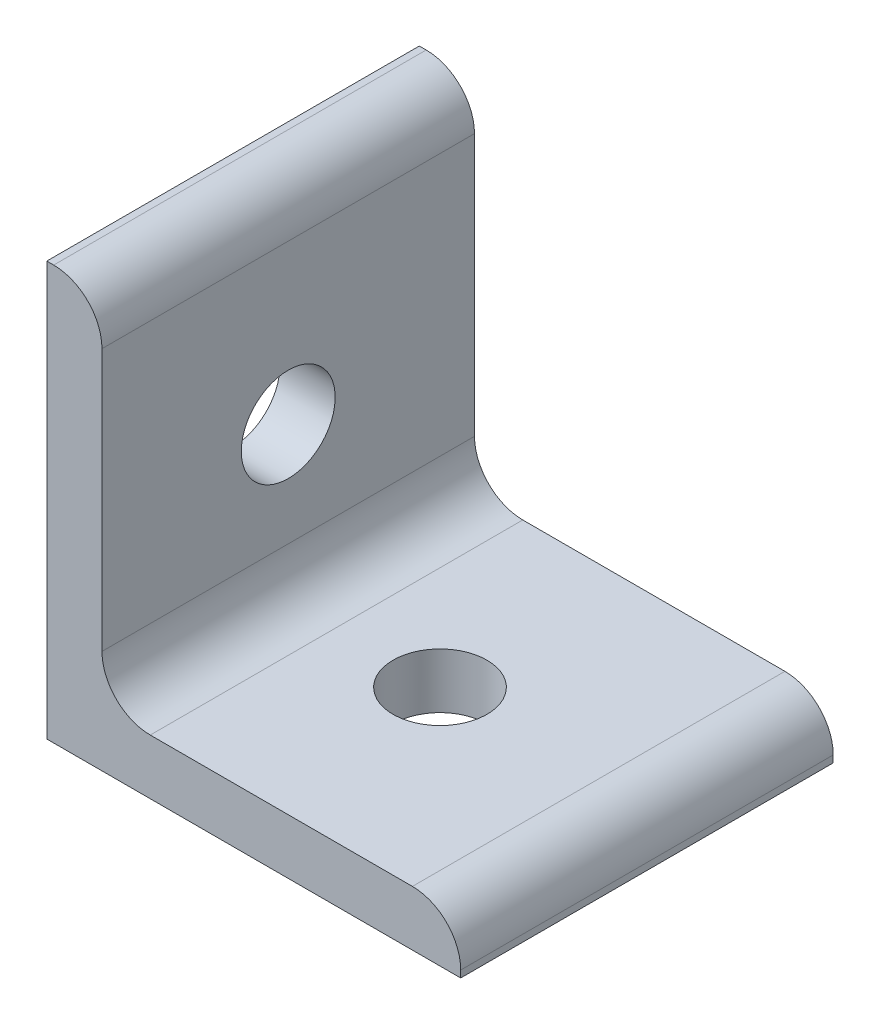
ISO-10303-21;
HEADER;
FILE_DESCRIPTION(('STEP AP214'),'2;1');
FILE_NAME('part.step','',(''),(''),'','','');
FILE_SCHEMA(('AUTOMOTIVE_DESIGN { 1 0 10303 214 1 1 1 1 }'));
ENDSEC;
DATA;
#1=APPLICATION_CONTEXT('core data for automotive mechanical design processes');
#2=APPLICATION_PROTOCOL_DEFINITION('international standard','automotive_design',2000,#1);
#3=PRODUCT_CONTEXT('',#1,'mechanical');
#4=PRODUCT('Part','Part','',(#3));
#5=PRODUCT_RELATED_PRODUCT_CATEGORY('part','',(#4));
#6=PRODUCT_DEFINITION_FORMATION('','',#4);
#7=PRODUCT_DEFINITION_CONTEXT('part definition',#1,'design');
#8=PRODUCT_DEFINITION('design','',#6,#7);
#9=PRODUCT_DEFINITION_SHAPE('','',#8);
#10=(LENGTH_UNIT() NAMED_UNIT(*) SI_UNIT(.MILLI.,.METRE.));
#11=(NAMED_UNIT(*) PLANE_ANGLE_UNIT() SI_UNIT($,.RADIAN.));
#12=(NAMED_UNIT(*) SI_UNIT($,.STERADIAN.) SOLID_ANGLE_UNIT());
#13=UNCERTAINTY_MEASURE_WITH_UNIT(LENGTH_MEASURE(1.E-05),#10,'distance_accuracy_value','');
#14=(GEOMETRIC_REPRESENTATION_CONTEXT(3) GLOBAL_UNCERTAINTY_ASSIGNED_CONTEXT((#13)) GLOBAL_UNIT_ASSIGNED_CONTEXT((#10,
#11,#12)) REPRESENTATION_CONTEXT('',''));
#15=CARTESIAN_POINT('',(0.,0.,0.));
#16=DIRECTION('',(0.,0.,1.));
#17=DIRECTION('',(1.,0.,0.));
#18=AXIS2_PLACEMENT_3D('',#15,#16,#17);
#19=CARTESIAN_POINT('',(0.,0.,-13.5));
#20=DIRECTION('',(-1.,0.,0.));
#21=DIRECTION('',(0.,0.,1.));
#22=AXIS2_PLACEMENT_3D('',#19,#20,#21);
#23=PLANE('',#22);
#24=CARTESIAN_POINT('',(0.,15.,0.));
#25=DIRECTION('',(-1.,0.,0.));
#26=DIRECTION('',(0.,0.,1.));
#27=AXIS2_PLACEMENT_3D('',#24,#25,#26);
#28=CIRCLE('',#27,3.4036);
#29=CARTESIAN_POINT('',(0.,15.,3.4036));
#30=VERTEX_POINT('',#29);
#31=EDGE_CURVE('E252',#30,#30,#28,.T.);
#32=ORIENTED_EDGE('',*,*,#31,.F.);
#33=EDGE_LOOP('',(#32));
#34=FACE_BOUND('',#33,.T.);
#35=DIRECTION('',(0.,-1.,0.));
#36=VECTOR('',#35,1.);
#37=CARTESIAN_POINT('',(0.,0.,13.5));
#38=LINE('',#37,#36);
#39=CARTESIAN_POINT('',(0.,30.,13.5));
#40=VERTEX_POINT('',#39);
#41=CARTESIAN_POINT('',(0.,0.,13.5));
#42=VERTEX_POINT('',#41);
#43=EDGE_CURVE('E153',#40,#42,#38,.T.);
#44=ORIENTED_EDGE('',*,*,#43,.F.);
#45=DIRECTION('',(0.,0.,1.));
#46=VECTOR('',#45,1.);
#47=CARTESIAN_POINT('',(0.,30.,-13.5));
#48=LINE('',#47,#46);
#49=CARTESIAN_POINT('',(0.,30.,-13.5));
#50=VERTEX_POINT('',#49);
#51=EDGE_CURVE('E11',#50,#40,#48,.T.);
#52=ORIENTED_EDGE('',*,*,#51,.F.);
#53=DIRECTION('',(0.,-1.,0.));
#54=VECTOR('',#53,1.);
#55=CARTESIAN_POINT('',(0.,0.,-13.5));
#56=LINE('',#55,#54);
#57=CARTESIAN_POINT('',(0.,0.,-13.5));
#58=VERTEX_POINT('',#57);
#59=EDGE_CURVE('E185',#50,#58,#56,.T.);
#60=ORIENTED_EDGE('',*,*,#59,.T.);
#61=DIRECTION('',(0.,0.,1.));
#62=VECTOR('',#61,1.);
#63=CARTESIAN_POINT('',(0.,0.,-13.5));
#64=LINE('',#63,#62);
#65=EDGE_CURVE('E103',#58,#42,#64,.T.);
#66=ORIENTED_EDGE('',*,*,#65,.T.);
#67=EDGE_LOOP('',(#44,#52,#60,#66));
#68=FACE_BOUND('',#67,.T.);
#69=ADVANCED_FACE('F43',(#34,#68),#23,.T.);
#70=CARTESIAN_POINT('',(0.,30.,-13.5));
#71=DIRECTION('',(0.,1.,0.));
#72=DIRECTION('',(-1.,0.,0.));
#73=AXIS2_PLACEMENT_3D('',#70,#71,#72);
#74=PLANE('',#73);
#75=DIRECTION('',(-1.,0.,0.));
#76=VECTOR('',#75,1.);
#77=CARTESIAN_POINT('',(0.,30.,13.5));
#78=LINE('',#77,#76);
#79=CARTESIAN_POINT('',(0.499999999999999,30.,13.5));
#80=VERTEX_POINT('',#79);
#81=EDGE_CURVE('E182',#80,#40,#78,.T.);
#82=ORIENTED_EDGE('',*,*,#81,.F.);
#83=DIRECTION('',(0.,0.,1.));
#84=VECTOR('',#83,1.);
#85=CARTESIAN_POINT('',(0.499999999999999,30.,-13.5));
#86=LINE('',#85,#84);
#87=CARTESIAN_POINT('',(0.499999999999999,30.,-13.5));
#88=VERTEX_POINT('',#87);
#89=EDGE_CURVE('E53',#88,#80,#86,.T.);
#90=ORIENTED_EDGE('',*,*,#89,.F.);
#91=DIRECTION('',(-1.,0.,0.));
#92=VECTOR('',#91,1.);
#93=CARTESIAN_POINT('',(0.,30.,-13.5));
#94=LINE('',#93,#92);
#95=EDGE_CURVE('E139',#88,#50,#94,.T.);
#96=ORIENTED_EDGE('',*,*,#95,.T.);
#97=ORIENTED_EDGE('',*,*,#51,.T.);
#98=EDGE_LOOP('',(#82,#90,#96,#97));
#99=FACE_BOUND('',#98,.T.);
#100=ADVANCED_FACE('F207',(#99),#74,.T.);
#101=CARTESIAN_POINT('',(0.499999999999999,26.5,-13.5));
#102=DIRECTION('',(0.,0.,1.));
#103=DIRECTION('',(1.,0.,0.));
#104=AXIS2_PLACEMENT_3D('',#101,#102,#103);
#105=CYLINDRICAL_SURFACE('',#104,3.5);
#106=CARTESIAN_POINT('',(0.499999999999999,26.5,13.5));
#107=DIRECTION('',(0.,0.,1.));
#108=DIRECTION('',(-1.,0.,0.));
#109=AXIS2_PLACEMENT_3D('',#106,#107,#108);
#110=CIRCLE('',#109,3.5);
#111=CARTESIAN_POINT('',(4.,26.5,13.5));
#112=VERTEX_POINT('',#111);
#113=EDGE_CURVE('E125',#112,#80,#110,.T.);
#114=ORIENTED_EDGE('',*,*,#113,.F.);
#115=DIRECTION('',(0.,0.,1.));
#116=VECTOR('',#115,1.);
#117=CARTESIAN_POINT('',(4.,26.5,-13.5));
#118=LINE('',#117,#116);
#119=CARTESIAN_POINT('',(4.,26.5,-13.5));
#120=VERTEX_POINT('',#119);
#121=EDGE_CURVE('E120',#120,#112,#118,.T.);
#122=ORIENTED_EDGE('',*,*,#121,.F.);
#123=CARTESIAN_POINT('',(0.499999999999999,26.5,-13.5));
#124=DIRECTION('',(0.,0.,1.));
#125=DIRECTION('',(-1.,0.,0.));
#126=AXIS2_PLACEMENT_3D('',#123,#124,#125);
#127=CIRCLE('',#126,3.5);
#128=EDGE_CURVE('E123',#120,#88,#127,.T.);
#129=ORIENTED_EDGE('',*,*,#128,.T.);
#130=ORIENTED_EDGE('',*,*,#89,.T.);
#131=EDGE_LOOP('',(#114,#122,#129,#130));
#132=FACE_BOUND('',#131,.T.);
#133=ADVANCED_FACE('F122',(#132),#105,.T.);
#134=CARTESIAN_POINT('',(4.,26.5,-13.5));
#135=DIRECTION('',(1.,0.,0.));
#136=DIRECTION('',(0.,1.,0.));
#137=AXIS2_PLACEMENT_3D('',#134,#135,#136);
#138=PLANE('',#137);
#139=CARTESIAN_POINT('',(4.,15.,0.));
#140=DIRECTION('',(1.,0.,0.));
#141=DIRECTION('',(0.,1.,0.));
#142=AXIS2_PLACEMENT_3D('',#139,#140,#141);
#143=CIRCLE('',#142,3.4036);
#144=CARTESIAN_POINT('',(4.,18.4036,0.));
#145=VERTEX_POINT('',#144);
#146=EDGE_CURVE('E46',#145,#145,#143,.T.);
#147=ORIENTED_EDGE('',*,*,#146,.F.);
#148=EDGE_LOOP('',(#147));
#149=FACE_BOUND('',#148,.T.);
#150=DIRECTION('',(0.,1.,0.));
#151=VECTOR('',#150,1.);
#152=CARTESIAN_POINT('',(4.,26.5,13.5));
#153=LINE('',#152,#151);
#154=CARTESIAN_POINT('',(4.,7.5,13.5));
#155=VERTEX_POINT('',#154);
#156=EDGE_CURVE('E177',#155,#112,#153,.T.);
#157=ORIENTED_EDGE('',*,*,#156,.F.);
#158=DIRECTION('',(0.,0.,1.));
#159=VECTOR('',#158,1.);
#160=CARTESIAN_POINT('',(4.,7.5,-13.5));
#161=LINE('',#160,#159);
#162=CARTESIAN_POINT('',(4.,7.5,-13.5));
#163=VERTEX_POINT('',#162);
#164=EDGE_CURVE('E131',#163,#155,#161,.T.);
#165=ORIENTED_EDGE('',*,*,#164,.F.);
#166=DIRECTION('',(0.,1.,0.));
#167=VECTOR('',#166,1.);
#168=CARTESIAN_POINT('',(4.,26.5,-13.5));
#169=LINE('',#168,#167);
#170=EDGE_CURVE('E137',#163,#120,#169,.T.);
#171=ORIENTED_EDGE('',*,*,#170,.T.);
#172=ORIENTED_EDGE('',*,*,#121,.T.);
#173=EDGE_LOOP('',(#157,#165,#171,#172));
#174=FACE_BOUND('',#173,.T.);
#175=ADVANCED_FACE('F142',(#149,#174),#138,.T.);
#176=CARTESIAN_POINT('',(7.5,7.5,-13.5));
#177=DIRECTION('',(0.,0.,1.));
#178=DIRECTION('',(1.,0.,0.));
#179=AXIS2_PLACEMENT_3D('',#176,#177,#178);
#180=CYLINDRICAL_SURFACE('',#179,3.5);
#181=CARTESIAN_POINT('',(7.5,7.5,13.5));
#182=DIRECTION('',(0.,0.,-1.));
#183=DIRECTION('',(-1.,0.,0.));
#184=AXIS2_PLACEMENT_3D('',#181,#182,#183);
#185=CIRCLE('',#184,3.5);
#186=CARTESIAN_POINT('',(7.5,4.,13.5));
#187=VERTEX_POINT('',#186);
#188=EDGE_CURVE('E173',#187,#155,#185,.T.);
#189=ORIENTED_EDGE('',*,*,#188,.F.);
#190=DIRECTION('',(0.,0.,1.));
#191=VECTOR('',#190,1.);
#192=CARTESIAN_POINT('',(7.5,4.,-13.5));
#193=LINE('',#192,#191);
#194=CARTESIAN_POINT('',(7.5,4.,-13.5));
#195=VERTEX_POINT('',#194);
#196=EDGE_CURVE('E191',#195,#187,#193,.T.);
#197=ORIENTED_EDGE('',*,*,#196,.F.);
#198=CARTESIAN_POINT('',(7.5,7.5,-13.5));
#199=DIRECTION('',(0.,0.,-1.));
#200=DIRECTION('',(-1.,0.,0.));
#201=AXIS2_PLACEMENT_3D('',#198,#199,#200);
#202=CIRCLE('',#201,3.5);
#203=EDGE_CURVE('E144',#195,#163,#202,.T.);
#204=ORIENTED_EDGE('',*,*,#203,.T.);
#205=ORIENTED_EDGE('',*,*,#164,.T.);
#206=EDGE_LOOP('',(#189,#197,#204,#205));
#207=FACE_BOUND('',#206,.T.);
#208=ADVANCED_FACE('F221',(#207),#180,.F.);
#209=CARTESIAN_POINT('',(26.5,4.,-13.5));
#210=DIRECTION('',(0.,1.,0.));
#211=DIRECTION('',(-1.,0.,0.));
#212=AXIS2_PLACEMENT_3D('',#209,#210,#211);
#213=PLANE('',#212);
#214=CARTESIAN_POINT('',(15.,4.,0.));
#215=DIRECTION('',(0.,1.,0.));
#216=DIRECTION('',(-1.,0.,0.));
#217=AXIS2_PLACEMENT_3D('',#214,#215,#216);
#218=CIRCLE('',#217,3.4036);
#219=CARTESIAN_POINT('',(11.5964,4.,0.));
#220=VERTEX_POINT('',#219);
#221=EDGE_CURVE('E248',#220,#220,#218,.T.);
#222=ORIENTED_EDGE('',*,*,#221,.F.);
#223=EDGE_LOOP('',(#222));
#224=FACE_BOUND('',#223,.T.);
#225=DIRECTION('',(-1.,0.,0.));
#226=VECTOR('',#225,1.);
#227=CARTESIAN_POINT('',(26.5,4.,13.5));
#228=LINE('',#227,#226);
#229=CARTESIAN_POINT('',(26.5,4.,13.5));
#230=VERTEX_POINT('',#229);
#231=EDGE_CURVE('E169',#230,#187,#228,.T.);
#232=ORIENTED_EDGE('',*,*,#231,.F.);
#233=DIRECTION('',(0.,0.,1.));
#234=VECTOR('',#233,1.);
#235=CARTESIAN_POINT('',(26.5,4.,-13.5));
#236=LINE('',#235,#234);
#237=CARTESIAN_POINT('',(26.5,4.,-13.5));
#238=VERTEX_POINT('',#237);
#239=EDGE_CURVE('E194',#238,#230,#236,.T.);
#240=ORIENTED_EDGE('',*,*,#239,.F.);
#241=DIRECTION('',(-1.,0.,0.));
#242=VECTOR('',#241,1.);
#243=CARTESIAN_POINT('',(26.5,4.,-13.5));
#244=LINE('',#243,#242);
#245=EDGE_CURVE('E147',#238,#195,#244,.T.);
#246=ORIENTED_EDGE('',*,*,#245,.T.);
#247=ORIENTED_EDGE('',*,*,#196,.T.);
#248=EDGE_LOOP('',(#232,#240,#246,#247));
#249=FACE_BOUND('',#248,.T.);
#250=ADVANCED_FACE('F225',(#224,#249),#213,.T.);
#251=CARTESIAN_POINT('',(26.5,0.500000000000001,-13.5));
#252=DIRECTION('',(0.,0.,1.));
#253=DIRECTION('',(1.,0.,0.));
#254=AXIS2_PLACEMENT_3D('',#251,#252,#253);
#255=CYLINDRICAL_SURFACE('',#254,3.5);
#256=CARTESIAN_POINT('',(26.5,0.500000000000001,13.5));
#257=DIRECTION('',(0.,0.,1.));
#258=DIRECTION('',(1.,0.,0.));
#259=AXIS2_PLACEMENT_3D('',#256,#257,#258);
#260=CIRCLE('',#259,3.5);
#261=CARTESIAN_POINT('',(30.,0.500000000000001,13.5));
#262=VERTEX_POINT('',#261);
#263=EDGE_CURVE('E165',#262,#230,#260,.T.);
#264=ORIENTED_EDGE('',*,*,#263,.F.);
#265=DIRECTION('',(0.,0.,1.));
#266=VECTOR('',#265,1.);
#267=CARTESIAN_POINT('',(30.,0.500000000000001,-13.5));
#268=LINE('',#267,#266);
#269=CARTESIAN_POINT('',(30.,0.500000000000001,-13.5));
#270=VERTEX_POINT('',#269);
#271=EDGE_CURVE('E197',#270,#262,#268,.T.);
#272=ORIENTED_EDGE('',*,*,#271,.F.);
#273=CARTESIAN_POINT('',(26.5,0.500000000000001,-13.5));
#274=DIRECTION('',(0.,0.,1.));
#275=DIRECTION('',(1.,0.,0.));
#276=AXIS2_PLACEMENT_3D('',#273,#274,#275);
#277=CIRCLE('',#276,3.5);
#278=EDGE_CURVE('E267',#270,#238,#277,.T.);
#279=ORIENTED_EDGE('',*,*,#278,.T.);
#280=ORIENTED_EDGE('',*,*,#239,.T.);
#281=EDGE_LOOP('',(#264,#272,#279,#280));
#282=FACE_BOUND('',#281,.T.);
#283=ADVANCED_FACE('F229',(#282),#255,.T.);
#284=CARTESIAN_POINT('',(30.,0.,-13.5));
#285=DIRECTION('',(1.,0.,0.));
#286=DIRECTION('',(0.,1.,0.));
#287=AXIS2_PLACEMENT_3D('',#284,#285,#286);
#288=PLANE('',#287);
#289=DIRECTION('',(0.,1.,0.));
#290=VECTOR('',#289,1.);
#291=CARTESIAN_POINT('',(30.,0.,13.5));
#292=LINE('',#291,#290);
#293=CARTESIAN_POINT('',(30.,0.,13.5));
#294=VERTEX_POINT('',#293);
#295=EDGE_CURVE('E161',#294,#262,#292,.T.);
#296=ORIENTED_EDGE('',*,*,#295,.F.);
#297=DIRECTION('',(0.,0.,1.));
#298=VECTOR('',#297,1.);
#299=CARTESIAN_POINT('',(30.,0.,-13.5));
#300=LINE('',#299,#298);
#301=CARTESIAN_POINT('',(30.,0.,-13.5));
#302=VERTEX_POINT('',#301);
#303=EDGE_CURVE('E200',#302,#294,#300,.T.);
#304=ORIENTED_EDGE('',*,*,#303,.F.);
#305=DIRECTION('',(0.,1.,0.));
#306=VECTOR('',#305,1.);
#307=CARTESIAN_POINT('',(30.,0.,-13.5));
#308=LINE('',#307,#306);
#309=EDGE_CURVE('E263',#302,#270,#308,.T.);
#310=ORIENTED_EDGE('',*,*,#309,.T.);
#311=ORIENTED_EDGE('',*,*,#271,.T.);
#312=EDGE_LOOP('',(#296,#304,#310,#311));
#313=FACE_BOUND('',#312,.T.);
#314=ADVANCED_FACE('F233',(#313),#288,.T.);
#315=CARTESIAN_POINT('',(0.,0.,-13.5));
#316=DIRECTION('',(0.,-1.,0.));
#317=DIRECTION('',(0.,0.,-1.));
#318=AXIS2_PLACEMENT_3D('',#315,#316,#317);
#319=PLANE('',#318);
#320=CARTESIAN_POINT('',(15.,0.,0.));
#321=DIRECTION('',(0.,-1.,0.));
#322=DIRECTION('',(0.,0.,-1.));
#323=AXIS2_PLACEMENT_3D('',#320,#321,#322);
#324=CIRCLE('',#323,3.4036);
#325=CARTESIAN_POINT('',(15.,0.,-3.4036));
#326=VERTEX_POINT('',#325);
#327=EDGE_CURVE('E245',#326,#326,#324,.T.);
#328=ORIENTED_EDGE('',*,*,#327,.F.);
#329=EDGE_LOOP('',(#328));
#330=FACE_BOUND('',#329,.T.);
#331=DIRECTION('',(1.,0.,0.));
#332=VECTOR('',#331,1.);
#333=CARTESIAN_POINT('',(0.,0.,13.5));
#334=LINE('',#333,#332);
#335=EDGE_CURVE('E157',#42,#294,#334,.T.);
#336=ORIENTED_EDGE('',*,*,#335,.F.);
#337=ORIENTED_EDGE('',*,*,#65,.F.);
#338=DIRECTION('',(1.,0.,0.));
#339=VECTOR('',#338,1.);
#340=CARTESIAN_POINT('',(0.,0.,-13.5));
#341=LINE('',#340,#339);
#342=EDGE_CURVE('E260',#58,#302,#341,.T.);
#343=ORIENTED_EDGE('',*,*,#342,.T.);
#344=ORIENTED_EDGE('',*,*,#303,.T.);
#345=EDGE_LOOP('',(#336,#337,#343,#344));
#346=FACE_BOUND('',#345,.T.);
#347=ADVANCED_FACE('F203',(#330,#346),#319,.T.);
#348=CARTESIAN_POINT('',(0.499999999999999,26.5,-13.5));
#349=DIRECTION('',(0.,0.,-1.));
#350=DIRECTION('',(-1.,0.,0.));
#351=AXIS2_PLACEMENT_3D('',#348,#349,#350);
#352=PLANE('',#351);
#353=ORIENTED_EDGE('',*,*,#59,.F.);
#354=ORIENTED_EDGE('',*,*,#95,.F.);
#355=ORIENTED_EDGE('',*,*,#128,.F.);
#356=ORIENTED_EDGE('',*,*,#170,.F.);
#357=ORIENTED_EDGE('',*,*,#203,.F.);
#358=ORIENTED_EDGE('',*,*,#245,.F.);
#359=ORIENTED_EDGE('',*,*,#278,.F.);
#360=ORIENTED_EDGE('',*,*,#309,.F.);
#361=ORIENTED_EDGE('',*,*,#342,.F.);
#362=EDGE_LOOP('',(#353,#354,#355,#356,#357,#358,#359,#360,#361));
#363=FACE_BOUND('',#362,.T.);
#364=ADVANCED_FACE('F135',(#363),#352,.T.);
#365=CARTESIAN_POINT('',(0.499999999999999,26.5,13.5));
#366=DIRECTION('',(0.,0.,-1.));
#367=DIRECTION('',(-1.,0.,0.));
#368=AXIS2_PLACEMENT_3D('',#365,#366,#367);
#369=PLANE('',#368);
#370=ORIENTED_EDGE('',*,*,#43,.T.);
#371=ORIENTED_EDGE('',*,*,#335,.T.);
#372=ORIENTED_EDGE('',*,*,#295,.T.);
#373=ORIENTED_EDGE('',*,*,#263,.T.);
#374=ORIENTED_EDGE('',*,*,#231,.T.);
#375=ORIENTED_EDGE('',*,*,#188,.T.);
#376=ORIENTED_EDGE('',*,*,#156,.T.);
#377=ORIENTED_EDGE('',*,*,#113,.T.);
#378=ORIENTED_EDGE('',*,*,#81,.T.);
#379=EDGE_LOOP('',(#370,#371,#372,#373,#374,#375,#376,#377,#378));
#380=FACE_BOUND('',#379,.T.);
#381=ADVANCED_FACE('F206',(#380),#369,.F.);
#382=CARTESIAN_POINT('',(10.,15.,0.));
#383=DIRECTION('',(-1.,0.,0.));
#384=DIRECTION('',(0.,0.,1.));
#385=AXIS2_PLACEMENT_3D('',#382,#383,#384);
#386=CYLINDRICAL_SURFACE('',#385,3.4036);
#387=ORIENTED_EDGE('',*,*,#146,.T.);
#388=EDGE_LOOP('',(#387));
#389=FACE_BOUND('',#388,.T.);
#390=ORIENTED_EDGE('',*,*,#31,.T.);
#391=EDGE_LOOP('',(#390));
#392=FACE_BOUND('',#391,.T.);
#393=ADVANCED_FACE('F283',(#389,#392),#386,.F.);
#394=CARTESIAN_POINT('',(15.,10.,0.));
#395=DIRECTION('',(0.,-1.,0.));
#396=DIRECTION('',(0.,0.,-1.));
#397=AXIS2_PLACEMENT_3D('',#394,#395,#396);
#398=CYLINDRICAL_SURFACE('',#397,3.4036);
#399=ORIENTED_EDGE('',*,*,#221,.T.);
#400=EDGE_LOOP('',(#399));
#401=FACE_BOUND('',#400,.T.);
#402=ORIENTED_EDGE('',*,*,#327,.T.);
#403=EDGE_LOOP('',(#402));
#404=FACE_BOUND('',#403,.T.);
#405=ADVANCED_FACE('F286',(#401,#404),#398,.F.);
#406=CLOSED_SHELL('',(#69,#100,#133,#175,#208,#250,#283,#314,#347,#364,#381,#393,#405));
#407=MANIFOLD_SOLID_BREP('B2',#406);
#408=ADVANCED_BREP_SHAPE_REPRESENTATION('',(#18,#407),#14);
#409=SHAPE_DEFINITION_REPRESENTATION(#9,#408);
ENDSEC;
END-ISO-10303-21;
